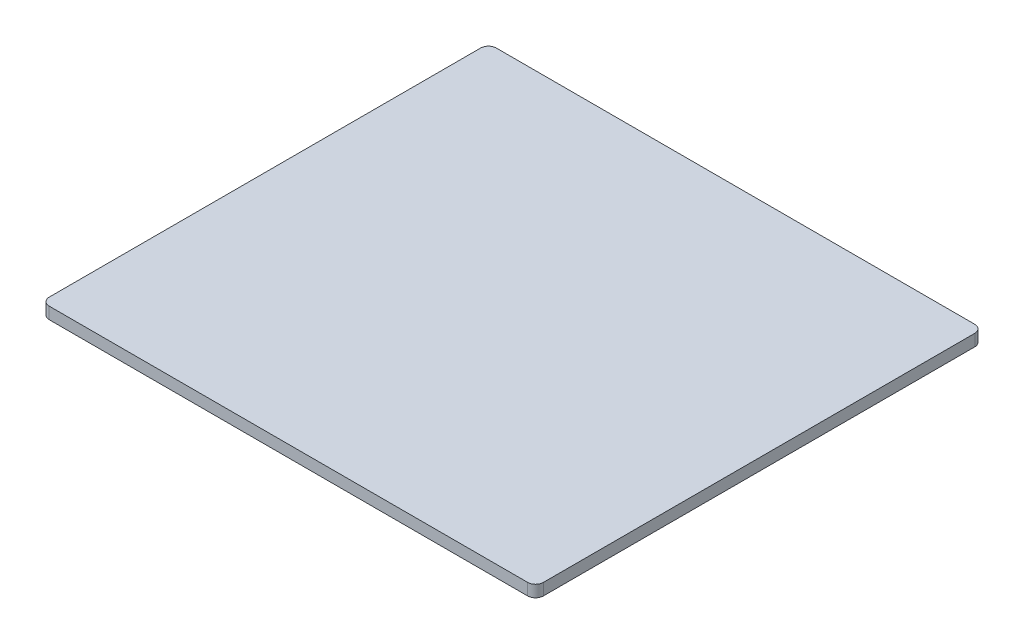
ISO-10303-21;
HEADER;
FILE_DESCRIPTION(('STEP AP214'),'2;1');
FILE_NAME('part.step','',(''),(''),'','','');
FILE_SCHEMA(('AUTOMOTIVE_DESIGN { 1 0 10303 214 1 1 1 1 }'));
ENDSEC;
DATA;
#1=APPLICATION_CONTEXT('core data for automotive mechanical design processes');
#2=APPLICATION_PROTOCOL_DEFINITION('international standard','automotive_design',2000,#1);
#3=PRODUCT_CONTEXT('',#1,'mechanical');
#4=PRODUCT('Part','Part','',(#3));
#5=PRODUCT_RELATED_PRODUCT_CATEGORY('part','',(#4));
#6=PRODUCT_DEFINITION_FORMATION('','',#4);
#7=PRODUCT_DEFINITION_CONTEXT('part definition',#1,'design');
#8=PRODUCT_DEFINITION('design','',#6,#7);
#9=PRODUCT_DEFINITION_SHAPE('','',#8);
#10=(LENGTH_UNIT() NAMED_UNIT(*) SI_UNIT(.MILLI.,.METRE.));
#11=(NAMED_UNIT(*) PLANE_ANGLE_UNIT() SI_UNIT($,.RADIAN.));
#12=(NAMED_UNIT(*) SI_UNIT($,.STERADIAN.) SOLID_ANGLE_UNIT());
#13=UNCERTAINTY_MEASURE_WITH_UNIT(LENGTH_MEASURE(1.E-05),#10,'distance_accuracy_value','');
#14=(GEOMETRIC_REPRESENTATION_CONTEXT(3) GLOBAL_UNCERTAINTY_ASSIGNED_CONTEXT((#13)) GLOBAL_UNIT_ASSIGNED_CONTEXT((#10,
#11,#12)) REPRESENTATION_CONTEXT('',''));
#15=CARTESIAN_POINT('',(0.,0.,0.));
#16=DIRECTION('',(0.,0.,1.));
#17=DIRECTION('',(1.,0.,0.));
#18=AXIS2_PLACEMENT_3D('',#15,#16,#17);
#19=CARTESIAN_POINT('',(-7.50495049504953,1.5,-17.9653465346535));
#20=DIRECTION('',(1.,0.,0.));
#21=DIRECTION('',(0.,0.,-1.));
#22=AXIS2_PLACEMENT_3D('',#19,#20,#21);
#23=PLANE('',#22);
#24=DIRECTION('',(0.,0.,1.));
#25=VECTOR('',#24,1.);
#26=CARTESIAN_POINT('',(-7.50495049504953,1.5,-17.9653465346535));
#27=LINE('',#26,#25);
#28=CARTESIAN_POINT('',(-7.50495049504953,1.5,-16.9653465346535));
#29=VERTEX_POINT('',#28);
#30=CARTESIAN_POINT('',(-7.50495049504951,1.5,38.0346534653465));
#31=VERTEX_POINT('',#30);
#32=EDGE_CURVE('E146',#29,#31,#27,.T.);
#33=ORIENTED_EDGE('',*,*,#32,.F.);
#34=DIRECTION('',(0.,-1.,0.));
#35=VECTOR('',#34,1.);
#36=CARTESIAN_POINT('',(-7.50495049504953,1.5,-16.9653465346535));
#37=LINE('',#36,#35);
#38=CARTESIAN_POINT('',(-7.50495049504953,0.,-16.9653465346535));
#39=VERTEX_POINT('',#38);
#40=EDGE_CURVE('E172',#29,#39,#37,.T.);
#41=ORIENTED_EDGE('',*,*,#40,.T.);
#42=DIRECTION('',(0.,0.,1.));
#43=VECTOR('',#42,1.);
#44=CARTESIAN_POINT('',(-7.50495049504953,0.,-17.9653465346535));
#45=LINE('',#44,#43);
#46=CARTESIAN_POINT('',(-7.50495049504951,0.,38.0346534653465));
#47=VERTEX_POINT('',#46);
#48=EDGE_CURVE('E148',#39,#47,#45,.T.);
#49=ORIENTED_EDGE('',*,*,#48,.T.);
#50=DIRECTION('',(0.,-1.,0.));
#51=VECTOR('',#50,1.);
#52=CARTESIAN_POINT('',(-7.50495049504951,1.5,38.0346534653465));
#53=LINE('',#52,#51);
#54=EDGE_CURVE('E169',#47,#31,#53,.F.);
#55=ORIENTED_EDGE('',*,*,#54,.T.);
#56=EDGE_LOOP('',(#33,#41,#49,#55));
#57=FACE_BOUND('',#56,.T.);
#58=ADVANCED_FACE('F43',(#57),#23,.F.);
#59=CARTESIAN_POINT('',(-7.50495049504951,1.5,39.0346534653465));
#60=DIRECTION('',(0.,0.,-1.));
#61=DIRECTION('',(-1.,0.,0.));
#62=AXIS2_PLACEMENT_3D('',#59,#60,#61);
#63=PLANE('',#62);
#64=DIRECTION('',(1.,0.,0.));
#65=VECTOR('',#64,1.);
#66=CARTESIAN_POINT('',(-7.50495049504951,1.5,39.0346534653465));
#67=LINE('',#66,#65);
#68=CARTESIAN_POINT('',(-6.50495049504951,1.5,39.0346534653465));
#69=VERTEX_POINT('',#68);
#70=CARTESIAN_POINT('',(54.4950495049505,1.5,39.0346534653465));
#71=VERTEX_POINT('',#70);
#72=EDGE_CURVE('E195',#69,#71,#67,.T.);
#73=ORIENTED_EDGE('',*,*,#72,.F.);
#74=DIRECTION('',(0.,-1.,0.));
#75=VECTOR('',#74,1.);
#76=CARTESIAN_POINT('',(-6.50495049504951,1.5,39.0346534653465));
#77=LINE('',#76,#75);
#78=CARTESIAN_POINT('',(-6.50495049504951,0.,39.0346534653465));
#79=VERTEX_POINT('',#78);
#80=EDGE_CURVE('E11',#69,#79,#77,.T.);
#81=ORIENTED_EDGE('',*,*,#80,.T.);
#82=DIRECTION('',(1.,0.,0.));
#83=VECTOR('',#82,1.);
#84=CARTESIAN_POINT('',(-7.50495049504951,0.,39.0346534653465));
#85=LINE('',#84,#83);
#86=CARTESIAN_POINT('',(54.4950495049505,0.,39.0346534653465));
#87=VERTEX_POINT('',#86);
#88=EDGE_CURVE('E142',#79,#87,#85,.T.);
#89=ORIENTED_EDGE('',*,*,#88,.T.);
#90=DIRECTION('',(0.,-1.,0.));
#91=VECTOR('',#90,1.);
#92=CARTESIAN_POINT('',(54.4950495049505,1.5,39.0346534653465));
#93=LINE('',#92,#91);
#94=EDGE_CURVE('E119',#87,#71,#93,.F.);
#95=ORIENTED_EDGE('',*,*,#94,.T.);
#96=EDGE_LOOP('',(#73,#81,#89,#95));
#97=FACE_BOUND('',#96,.T.);
#98=ADVANCED_FACE('F213',(#97),#63,.F.);
#99=CARTESIAN_POINT('',(55.4950495049505,1.5,-17.9653465346535));
#100=DIRECTION('',(-1.,0.,0.));
#101=DIRECTION('',(0.,0.,1.));
#102=AXIS2_PLACEMENT_3D('',#99,#100,#101);
#103=PLANE('',#102);
#104=DIRECTION('',(0.,0.,-1.));
#105=VECTOR('',#104,1.);
#106=CARTESIAN_POINT('',(55.4950495049505,0.,-17.9653465346535));
#107=LINE('',#106,#105);
#108=CARTESIAN_POINT('',(55.4950495049505,0.,38.0346534653465));
#109=VERTEX_POINT('',#108);
#110=CARTESIAN_POINT('',(55.4950495049505,0.,-16.9653465346535));
#111=VERTEX_POINT('',#110);
#112=EDGE_CURVE('E129',#109,#111,#107,.T.);
#113=ORIENTED_EDGE('',*,*,#112,.T.);
#114=DIRECTION('',(0.,-1.,0.));
#115=VECTOR('',#114,1.);
#116=CARTESIAN_POINT('',(55.4950495049505,1.5,-16.9653465346535));
#117=LINE('',#116,#115);
#118=CARTESIAN_POINT('',(55.4950495049505,1.5,-16.9653465346535));
#119=VERTEX_POINT('',#118);
#120=EDGE_CURVE('E163',#111,#119,#117,.F.);
#121=ORIENTED_EDGE('',*,*,#120,.T.);
#122=DIRECTION('',(0.,0.,-1.));
#123=VECTOR('',#122,1.);
#124=CARTESIAN_POINT('',(55.4950495049505,1.5,-17.9653465346535));
#125=LINE('',#124,#123);
#126=CARTESIAN_POINT('',(55.4950495049505,1.5,38.0346534653465));
#127=VERTEX_POINT('',#126);
#128=EDGE_CURVE('E132',#127,#119,#125,.T.);
#129=ORIENTED_EDGE('',*,*,#128,.F.);
#130=DIRECTION('',(0.,-1.,0.));
#131=VECTOR('',#130,1.);
#132=CARTESIAN_POINT('',(55.4950495049505,1.5,38.0346534653465));
#133=LINE('',#132,#131);
#134=EDGE_CURVE('E117',#127,#109,#133,.T.);
#135=ORIENTED_EDGE('',*,*,#134,.T.);
#136=EDGE_LOOP('',(#113,#121,#129,#135));
#137=FACE_BOUND('',#136,.T.);
#138=ADVANCED_FACE('F128',(#137),#103,.F.);
#139=CARTESIAN_POINT('',(-7.50495049504953,1.5,-17.9653465346535));
#140=DIRECTION('',(0.,0.,1.));
#141=DIRECTION('',(1.,0.,0.));
#142=AXIS2_PLACEMENT_3D('',#139,#140,#141);
#143=PLANE('',#142);
#144=DIRECTION('',(-1.,0.,0.));
#145=VECTOR('',#144,1.);
#146=CARTESIAN_POINT('',(-7.50495049504953,0.,-17.9653465346535));
#147=LINE('',#146,#145);
#148=CARTESIAN_POINT('',(54.4950495049505,0.,-17.9653465346535));
#149=VERTEX_POINT('',#148);
#150=CARTESIAN_POINT('',(-6.50495049504953,0.,-17.9653465346535));
#151=VERTEX_POINT('',#150);
#152=EDGE_CURVE('E141',#149,#151,#147,.T.);
#153=ORIENTED_EDGE('',*,*,#152,.T.);
#154=DIRECTION('',(0.,-1.,0.));
#155=VECTOR('',#154,1.);
#156=CARTESIAN_POINT('',(-6.50495049504953,1.5,-17.9653465346535));
#157=LINE('',#156,#155);
#158=CARTESIAN_POINT('',(-6.50495049504953,1.5,-17.9653465346535));
#159=VERTEX_POINT('',#158);
#160=EDGE_CURVE('E67',#151,#159,#157,.F.);
#161=ORIENTED_EDGE('',*,*,#160,.T.);
#162=DIRECTION('',(-1.,0.,0.));
#163=VECTOR('',#162,1.);
#164=CARTESIAN_POINT('',(-7.50495049504953,1.5,-17.9653465346535));
#165=LINE('',#164,#163);
#166=CARTESIAN_POINT('',(54.4950495049505,1.5,-17.9653465346535));
#167=VERTEX_POINT('',#166);
#168=EDGE_CURVE('E134',#167,#159,#165,.T.);
#169=ORIENTED_EDGE('',*,*,#168,.F.);
#170=DIRECTION('',(0.,-1.,0.));
#171=VECTOR('',#170,1.);
#172=CARTESIAN_POINT('',(54.4950495049505,1.5,-17.9653465346535));
#173=LINE('',#172,#171);
#174=EDGE_CURVE('E157',#167,#149,#173,.T.);
#175=ORIENTED_EDGE('',*,*,#174,.T.);
#176=EDGE_LOOP('',(#153,#161,#169,#175));
#177=FACE_BOUND('',#176,.T.);
#178=ADVANCED_FACE('F198',(#177),#143,.F.);
#179=CARTESIAN_POINT('',(0.,1.5,0.));
#180=DIRECTION('',(0.,1.,0.));
#181=DIRECTION('',(0.,0.,1.));
#182=AXIS2_PLACEMENT_3D('',#179,#180,#181);
#183=PLANE('',#182);
#184=ORIENTED_EDGE('',*,*,#168,.T.);
#185=CARTESIAN_POINT('',(-6.50495049504953,1.5,-16.9653465346535));
#186=DIRECTION('',(0.,1.,0.));
#187=DIRECTION('',(0.,0.,1.));
#188=AXIS2_PLACEMENT_3D('',#185,#186,#187);
#189=CIRCLE('',#188,1.);
#190=EDGE_CURVE('E52',#159,#29,#189,.T.);
#191=ORIENTED_EDGE('',*,*,#190,.T.);
#192=ORIENTED_EDGE('',*,*,#32,.T.);
#193=CARTESIAN_POINT('',(-6.50495049504951,1.5,38.0346534653465));
#194=DIRECTION('',(0.,1.,0.));
#195=DIRECTION('',(0.,0.,1.));
#196=AXIS2_PLACEMENT_3D('',#193,#194,#195);
#197=CIRCLE('',#196,1.);
#198=EDGE_CURVE('E59',#31,#69,#197,.T.);
#199=ORIENTED_EDGE('',*,*,#198,.T.);
#200=ORIENTED_EDGE('',*,*,#72,.T.);
#201=CARTESIAN_POINT('',(54.4950495049505,1.5,38.0346534653465));
#202=DIRECTION('',(0.,1.,0.));
#203=DIRECTION('',(0.,0.,1.));
#204=AXIS2_PLACEMENT_3D('',#201,#202,#203);
#205=CIRCLE('',#204,1.);
#206=EDGE_CURVE('E154',#71,#127,#205,.T.);
#207=ORIENTED_EDGE('',*,*,#206,.T.);
#208=ORIENTED_EDGE('',*,*,#128,.T.);
#209=CARTESIAN_POINT('',(54.4950495049505,1.5,-16.9653465346535));
#210=DIRECTION('',(0.,1.,0.));
#211=DIRECTION('',(0.,0.,1.));
#212=AXIS2_PLACEMENT_3D('',#209,#210,#211);
#213=CIRCLE('',#212,1.);
#214=EDGE_CURVE('E166',#119,#167,#213,.T.);
#215=ORIENTED_EDGE('',*,*,#214,.T.);
#216=EDGE_LOOP('',(#184,#191,#192,#199,#200,#207,#208,#215));
#217=FACE_BOUND('',#216,.T.);
#218=ADVANCED_FACE('F188',(#217),#183,.T.);
#219=CARTESIAN_POINT('',(0.,0.,0.));
#220=DIRECTION('',(0.,1.,0.));
#221=DIRECTION('',(0.,0.,1.));
#222=AXIS2_PLACEMENT_3D('',#219,#220,#221);
#223=PLANE('',#222);
#224=ORIENTED_EDGE('',*,*,#48,.F.);
#225=CARTESIAN_POINT('',(-6.50495049504953,0.,-16.9653465346535));
#226=DIRECTION('',(0.,1.,0.));
#227=DIRECTION('',(0.,0.,1.));
#228=AXIS2_PLACEMENT_3D('',#225,#226,#227);
#229=CIRCLE('',#228,1.);
#230=EDGE_CURVE('E179',#39,#151,#229,.F.);
#231=ORIENTED_EDGE('',*,*,#230,.T.);
#232=ORIENTED_EDGE('',*,*,#152,.F.);
#233=CARTESIAN_POINT('',(54.4950495049505,0.,-16.9653465346535));
#234=DIRECTION('',(0.,1.,0.));
#235=DIRECTION('',(0.,0.,1.));
#236=AXIS2_PLACEMENT_3D('',#233,#234,#235);
#237=CIRCLE('',#236,1.);
#238=EDGE_CURVE('E139',#149,#111,#237,.F.);
#239=ORIENTED_EDGE('',*,*,#238,.T.);
#240=ORIENTED_EDGE('',*,*,#112,.F.);
#241=CARTESIAN_POINT('',(54.4950495049505,0.,38.0346534653465));
#242=DIRECTION('',(0.,1.,0.));
#243=DIRECTION('',(0.,0.,1.));
#244=AXIS2_PLACEMENT_3D('',#241,#242,#243);
#245=CIRCLE('',#244,1.);
#246=EDGE_CURVE('E113',#109,#87,#245,.F.);
#247=ORIENTED_EDGE('',*,*,#246,.T.);
#248=ORIENTED_EDGE('',*,*,#88,.F.);
#249=CARTESIAN_POINT('',(-6.50495049504951,0.,38.0346534653465));
#250=DIRECTION('',(0.,1.,0.));
#251=DIRECTION('',(0.,0.,1.));
#252=AXIS2_PLACEMENT_3D('',#249,#250,#251);
#253=CIRCLE('',#252,1.);
#254=EDGE_CURVE('E176',#79,#47,#253,.F.);
#255=ORIENTED_EDGE('',*,*,#254,.T.);
#256=EDGE_LOOP('',(#224,#231,#232,#239,#240,#247,#248,#255));
#257=FACE_BOUND('',#256,.T.);
#258=ADVANCED_FACE('F137',(#257),#223,.F.);
#259=CARTESIAN_POINT('',(54.4950495049505,1.5,38.0346534653465));
#260=DIRECTION('',(0.,-1.,0.));
#261=DIRECTION('',(0.,0.,-1.));
#262=AXIS2_PLACEMENT_3D('',#259,#260,#261);
#263=CYLINDRICAL_SURFACE('',#262,1.);
#264=ORIENTED_EDGE('',*,*,#206,.F.);
#265=ORIENTED_EDGE('',*,*,#94,.F.);
#266=ORIENTED_EDGE('',*,*,#246,.F.);
#267=ORIENTED_EDGE('',*,*,#134,.F.);
#268=EDGE_LOOP('',(#264,#265,#266,#267));
#269=FACE_BOUND('',#268,.T.);
#270=ADVANCED_FACE('F116',(#269),#263,.T.);
#271=CARTESIAN_POINT('',(54.4950495049505,1.5,-16.9653465346535));
#272=DIRECTION('',(0.,-1.,0.));
#273=DIRECTION('',(0.,0.,-1.));
#274=AXIS2_PLACEMENT_3D('',#271,#272,#273);
#275=CYLINDRICAL_SURFACE('',#274,1.);
#276=ORIENTED_EDGE('',*,*,#214,.F.);
#277=ORIENTED_EDGE('',*,*,#120,.F.);
#278=ORIENTED_EDGE('',*,*,#238,.F.);
#279=ORIENTED_EDGE('',*,*,#174,.F.);
#280=EDGE_LOOP('',(#276,#277,#278,#279));
#281=FACE_BOUND('',#280,.T.);
#282=ADVANCED_FACE('F202',(#281),#275,.T.);
#283=CARTESIAN_POINT('',(-6.50495049504953,1.5,-16.9653465346535));
#284=DIRECTION('',(0.,-1.,0.));
#285=DIRECTION('',(0.,0.,-1.));
#286=AXIS2_PLACEMENT_3D('',#283,#284,#285);
#287=CYLINDRICAL_SURFACE('',#286,1.);
#288=ORIENTED_EDGE('',*,*,#190,.F.);
#289=ORIENTED_EDGE('',*,*,#160,.F.);
#290=ORIENTED_EDGE('',*,*,#230,.F.);
#291=ORIENTED_EDGE('',*,*,#40,.F.);
#292=EDGE_LOOP('',(#288,#289,#290,#291));
#293=FACE_BOUND('',#292,.T.);
#294=ADVANCED_FACE('F197',(#293),#287,.T.);
#295=CARTESIAN_POINT('',(-6.50495049504951,1.5,38.0346534653465));
#296=DIRECTION('',(0.,-1.,0.));
#297=DIRECTION('',(0.,0.,-1.));
#298=AXIS2_PLACEMENT_3D('',#295,#296,#297);
#299=CYLINDRICAL_SURFACE('',#298,1.);
#300=ORIENTED_EDGE('',*,*,#198,.F.);
#301=ORIENTED_EDGE('',*,*,#54,.F.);
#302=ORIENTED_EDGE('',*,*,#254,.F.);
#303=ORIENTED_EDGE('',*,*,#80,.F.);
#304=EDGE_LOOP('',(#300,#301,#302,#303));
#305=FACE_BOUND('',#304,.T.);
#306=ADVANCED_FACE('F45',(#305),#299,.T.);
#307=CLOSED_SHELL('',(#58,#98,#138,#178,#218,#258,#270,#282,#294,#306));
#308=MANIFOLD_SOLID_BREP('B2',#307);
#309=ADVANCED_BREP_SHAPE_REPRESENTATION('',(#18,#308),#14);
#310=SHAPE_DEFINITION_REPRESENTATION(#9,#309);
ENDSEC;
END-ISO-10303-21;
